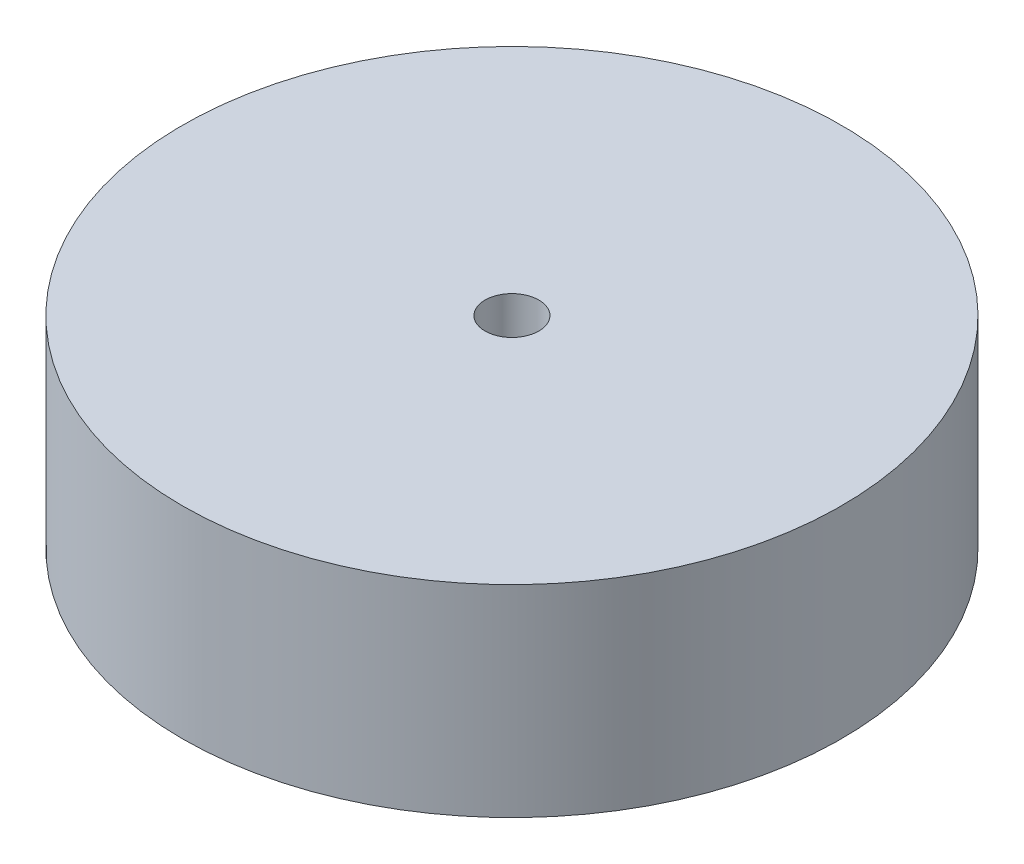
ISO-10303-21;
HEADER;
FILE_DESCRIPTION(('STEP AP214'),'2;1');
FILE_NAME('part.step','',(''),(''),'','','');
FILE_SCHEMA(('AUTOMOTIVE_DESIGN { 1 0 10303 214 1 1 1 1 }'));
ENDSEC;
DATA;
#1=APPLICATION_CONTEXT('core data for automotive mechanical design processes');
#2=APPLICATION_PROTOCOL_DEFINITION('international standard','automotive_design',2000,#1);
#3=PRODUCT_CONTEXT('',#1,'mechanical');
#4=PRODUCT('Part','Part','',(#3));
#5=PRODUCT_RELATED_PRODUCT_CATEGORY('part','',(#4));
#6=PRODUCT_DEFINITION_FORMATION('','',#4);
#7=PRODUCT_DEFINITION_CONTEXT('part definition',#1,'design');
#8=PRODUCT_DEFINITION('design','',#6,#7);
#9=PRODUCT_DEFINITION_SHAPE('','',#8);
#10=(LENGTH_UNIT() NAMED_UNIT(*) SI_UNIT(.MILLI.,.METRE.));
#11=(NAMED_UNIT(*) PLANE_ANGLE_UNIT() SI_UNIT($,.RADIAN.));
#12=(NAMED_UNIT(*) SI_UNIT($,.STERADIAN.) SOLID_ANGLE_UNIT());
#13=UNCERTAINTY_MEASURE_WITH_UNIT(LENGTH_MEASURE(1.E-05),#10,'distance_accuracy_value','');
#14=(GEOMETRIC_REPRESENTATION_CONTEXT(3) GLOBAL_UNCERTAINTY_ASSIGNED_CONTEXT((#13)) GLOBAL_UNIT_ASSIGNED_CONTEXT((#10,
#11,#12)) REPRESENTATION_CONTEXT('',''));
#15=CARTESIAN_POINT('',(0.,0.,0.));
#16=DIRECTION('',(0.,0.,1.));
#17=DIRECTION('',(1.,0.,0.));
#18=AXIS2_PLACEMENT_3D('',#15,#16,#17);
#19=CARTESIAN_POINT('',(0.,15.,0.));
#20=DIRECTION('',(0.,-1.,0.));
#21=DIRECTION('',(0.,0.,-1.));
#22=AXIS2_PLACEMENT_3D('',#19,#20,#21);
#23=CYLINDRICAL_SURFACE('',#22,24.5);
#24=CARTESIAN_POINT('',(0.,15.,0.));
#25=DIRECTION('',(0.,1.,0.));
#26=DIRECTION('',(0.,0.,1.));
#27=AXIS2_PLACEMENT_3D('',#24,#25,#26);
#28=CIRCLE('',#27,24.5);
#29=CARTESIAN_POINT('',(0.,15.,24.5));
#30=VERTEX_POINT('',#29);
#31=EDGE_CURVE('E10',#30,#30,#28,.T.);
#32=ORIENTED_EDGE('',*,*,#31,.F.);
#33=EDGE_LOOP('',(#32));
#34=FACE_BOUND('',#33,.T.);
#35=CARTESIAN_POINT('',(0.,0.,0.));
#36=DIRECTION('',(0.,1.,0.));
#37=DIRECTION('',(0.,0.,1.));
#38=AXIS2_PLACEMENT_3D('',#35,#36,#37);
#39=CIRCLE('',#38,24.5);
#40=CARTESIAN_POINT('',(0.,0.,24.5));
#41=VERTEX_POINT('',#40);
#42=EDGE_CURVE('E46',#41,#41,#39,.T.);
#43=ORIENTED_EDGE('',*,*,#42,.T.);
#44=EDGE_LOOP('',(#43));
#45=FACE_BOUND('',#44,.T.);
#46=ADVANCED_FACE('F39',(#34,#45),#23,.T.);
#47=CARTESIAN_POINT('',(0.,15.,0.));
#48=DIRECTION('',(0.,1.,0.));
#49=DIRECTION('',(0.,0.,1.));
#50=AXIS2_PLACEMENT_3D('',#47,#48,#49);
#51=PLANE('',#50);
#52=CARTESIAN_POINT('',(0.,15.,0.));
#53=DIRECTION('',(0.,1.,0.));
#54=DIRECTION('',(0.,0.,1.));
#55=AXIS2_PLACEMENT_3D('',#52,#53,#54);
#56=CIRCLE('',#55,2.);
#57=CARTESIAN_POINT('',(0.,15.,2.));
#58=VERTEX_POINT('',#57);
#59=EDGE_CURVE('E52',#58,#58,#56,.T.);
#60=ORIENTED_EDGE('',*,*,#59,.F.);
#61=EDGE_LOOP('',(#60));
#62=FACE_BOUND('',#61,.T.);
#63=ORIENTED_EDGE('',*,*,#31,.T.);
#64=EDGE_LOOP('',(#63));
#65=FACE_BOUND('',#64,.T.);
#66=ADVANCED_FACE('F68',(#62,#65),#51,.T.);
#67=CARTESIAN_POINT('',(0.,0.,0.));
#68=DIRECTION('',(0.,1.,0.));
#69=DIRECTION('',(0.,0.,1.));
#70=AXIS2_PLACEMENT_3D('',#67,#68,#69);
#71=PLANE('',#70);
#72=CARTESIAN_POINT('',(0.,0.,0.));
#73=DIRECTION('',(0.,1.,0.));
#74=DIRECTION('',(0.,0.,1.));
#75=AXIS2_PLACEMENT_3D('',#72,#73,#74);
#76=CIRCLE('',#75,2.);
#77=CARTESIAN_POINT('',(0.,0.,2.));
#78=VERTEX_POINT('',#77);
#79=EDGE_CURVE('E42',#78,#78,#76,.T.);
#80=ORIENTED_EDGE('',*,*,#79,.T.);
#81=EDGE_LOOP('',(#80));
#82=FACE_BOUND('',#81,.T.);
#83=ORIENTED_EDGE('',*,*,#42,.F.);
#84=EDGE_LOOP('',(#83));
#85=FACE_BOUND('',#84,.T.);
#86=ADVANCED_FACE('F59',(#82,#85),#71,.F.);
#87=CARTESIAN_POINT('',(0.,-1.2E-05,0.));
#88=DIRECTION('',(0.,1.,0.));
#89=DIRECTION('',(0.,0.,1.));
#90=AXIS2_PLACEMENT_3D('',#87,#88,#89);
#91=CYLINDRICAL_SURFACE('',#90,2.);
#92=ORIENTED_EDGE('',*,*,#59,.T.);
#93=EDGE_LOOP('',(#92));
#94=FACE_BOUND('',#93,.T.);
#95=ORIENTED_EDGE('',*,*,#79,.F.);
#96=EDGE_LOOP('',(#95));
#97=FACE_BOUND('',#96,.T.);
#98=ADVANCED_FACE('F62',(#94,#97),#91,.F.);
#99=CLOSED_SHELL('',(#46,#66,#86,#98));
#100=MANIFOLD_SOLID_BREP('B2',#99);
#101=ADVANCED_BREP_SHAPE_REPRESENTATION('',(#18,#100),#14);
#102=SHAPE_DEFINITION_REPRESENTATION(#9,#101);
ENDSEC;
END-ISO-10303-21;
